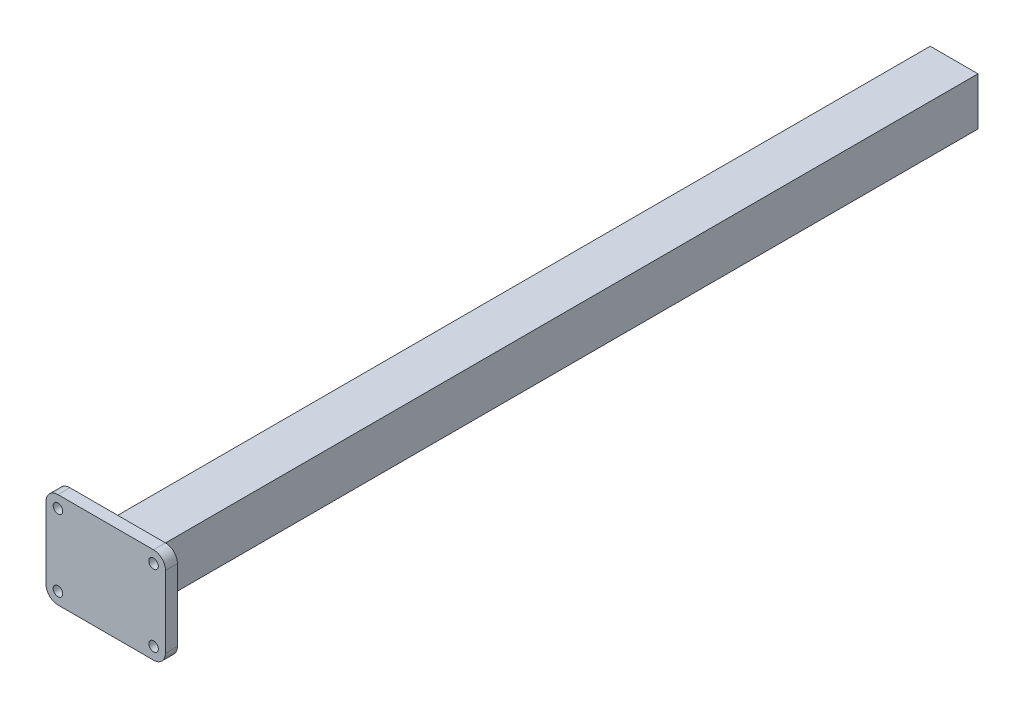
ISO-10303-21;
HEADER;
FILE_DESCRIPTION(('STEP AP214'),'2;1');
FILE_NAME('part.step','',(''),(''),'','','');
FILE_SCHEMA(('AUTOMOTIVE_DESIGN { 1 0 10303 214 1 1 1 1 }'));
ENDSEC;
DATA;
#1=APPLICATION_CONTEXT('core data for automotive mechanical design processes');
#2=APPLICATION_PROTOCOL_DEFINITION('international standard','automotive_design',2000,#1);
#3=PRODUCT_CONTEXT('',#1,'mechanical');
#4=PRODUCT('Part','Part','',(#3));
#5=PRODUCT_RELATED_PRODUCT_CATEGORY('part','',(#4));
#6=PRODUCT_DEFINITION_FORMATION('','',#4);
#7=PRODUCT_DEFINITION_CONTEXT('part definition',#1,'design');
#8=PRODUCT_DEFINITION('design','',#6,#7);
#9=PRODUCT_DEFINITION_SHAPE('','',#8);
#10=(LENGTH_UNIT() NAMED_UNIT(*) SI_UNIT(.MILLI.,.METRE.));
#11=(NAMED_UNIT(*) PLANE_ANGLE_UNIT() SI_UNIT($,.RADIAN.));
#12=(NAMED_UNIT(*) SI_UNIT($,.STERADIAN.) SOLID_ANGLE_UNIT());
#13=UNCERTAINTY_MEASURE_WITH_UNIT(LENGTH_MEASURE(1.E-05),#10,'distance_accuracy_value','');
#14=(GEOMETRIC_REPRESENTATION_CONTEXT(3) GLOBAL_UNCERTAINTY_ASSIGNED_CONTEXT((#13)) GLOBAL_UNIT_ASSIGNED_CONTEXT((#10,
#11,#12)) REPRESENTATION_CONTEXT('',''));
#15=CARTESIAN_POINT('',(0.,0.,0.));
#16=DIRECTION('',(0.,0.,1.));
#17=DIRECTION('',(1.,0.,0.));
#18=AXIS2_PLACEMENT_3D('',#15,#16,#17);
#19=CARTESIAN_POINT('',(0.,0.,0.));
#20=DIRECTION('',(0.,0.,-1.));
#21=DIRECTION('',(-1.,0.,0.));
#22=AXIS2_PLACEMENT_3D('',#19,#20,#21);
#23=PLANE('',#22);
#24=DIRECTION('',(0.,1.,0.));
#25=VECTOR('',#24,1.);
#26=CARTESIAN_POINT('',(20.,-20.,0.));
#27=LINE('',#26,#25);
#28=CARTESIAN_POINT('',(20.,-20.,0.));
#29=VERTEX_POINT('',#28);
#30=CARTESIAN_POINT('',(20.,20.,0.));
#31=VERTEX_POINT('',#30);
#32=EDGE_CURVE('E218',#29,#31,#27,.T.);
#33=ORIENTED_EDGE('',*,*,#32,.F.);
#34=DIRECTION('',(1.,0.,0.));
#35=VECTOR('',#34,1.);
#36=CARTESIAN_POINT('',(-20.,-20.,0.));
#37=LINE('',#36,#35);
#38=CARTESIAN_POINT('',(-20.,-20.,0.));
#39=VERTEX_POINT('',#38);
#40=EDGE_CURVE('E77',#39,#29,#37,.T.);
#41=ORIENTED_EDGE('',*,*,#40,.F.);
#42=DIRECTION('',(0.,-1.,0.));
#43=VECTOR('',#42,1.);
#44=CARTESIAN_POINT('',(-20.,-20.,0.));
#45=LINE('',#44,#43);
#46=CARTESIAN_POINT('',(-20.,20.,0.));
#47=VERTEX_POINT('',#46);
#48=EDGE_CURVE('E234',#47,#39,#45,.T.);
#49=ORIENTED_EDGE('',*,*,#48,.F.);
#50=DIRECTION('',(-1.,0.,0.));
#51=VECTOR('',#50,1.);
#52=CARTESIAN_POINT('',(-20.,20.,0.));
#53=LINE('',#52,#51);
#54=EDGE_CURVE('E232',#31,#47,#53,.T.);
#55=ORIENTED_EDGE('',*,*,#54,.F.);
#56=EDGE_LOOP('',(#33,#41,#49,#55));
#57=FACE_BOUND('',#56,.T.);
#58=DIRECTION('',(1.,0.,0.));
#59=VECTOR('',#58,1.);
#60=CARTESIAN_POINT('',(-18.5,-18.5,0.));
#61=LINE('',#60,#59);
#62=CARTESIAN_POINT('',(-18.5,-18.5,0.));
#63=VERTEX_POINT('',#62);
#64=CARTESIAN_POINT('',(18.5,-18.5,0.));
#65=VERTEX_POINT('',#64);
#66=EDGE_CURVE('E194',#63,#65,#61,.T.);
#67=ORIENTED_EDGE('',*,*,#66,.T.);
#68=DIRECTION('',(0.,1.,0.));
#69=VECTOR('',#68,1.);
#70=CARTESIAN_POINT('',(18.5,-18.5,0.));
#71=LINE('',#70,#69);
#72=CARTESIAN_POINT('',(18.5,18.5,0.));
#73=VERTEX_POINT('',#72);
#74=EDGE_CURVE('E48',#65,#73,#71,.T.);
#75=ORIENTED_EDGE('',*,*,#74,.T.);
#76=DIRECTION('',(-1.,0.,0.));
#77=VECTOR('',#76,1.);
#78=CARTESIAN_POINT('',(-18.5,18.5,0.));
#79=LINE('',#78,#77);
#80=CARTESIAN_POINT('',(-18.5,18.5,0.));
#81=VERTEX_POINT('',#80);
#82=EDGE_CURVE('E184',#73,#81,#79,.T.);
#83=ORIENTED_EDGE('',*,*,#82,.T.);
#84=DIRECTION('',(0.,-1.,0.));
#85=VECTOR('',#84,1.);
#86=CARTESIAN_POINT('',(-18.5,-18.5,0.));
#87=LINE('',#86,#85);
#88=EDGE_CURVE('E206',#81,#63,#87,.T.);
#89=ORIENTED_EDGE('',*,*,#88,.T.);
#90=EDGE_LOOP('',(#67,#75,#83,#89));
#91=FACE_BOUND('',#90,.T.);
#92=ADVANCED_FACE('F33',(#57,#91),#23,.T.);
#93=CARTESIAN_POINT('',(20.,-20.,700.));
#94=DIRECTION('',(-1.,0.,0.));
#95=DIRECTION('',(0.,0.,1.));
#96=AXIS2_PLACEMENT_3D('',#93,#94,#95);
#97=PLANE('',#96);
#98=ORIENTED_EDGE('',*,*,#32,.T.);
#99=DIRECTION('',(0.,0.,-1.));
#100=VECTOR('',#99,1.);
#101=CARTESIAN_POINT('',(20.,20.,700.));
#102=LINE('',#101,#100);
#103=CARTESIAN_POINT('',(20.,20.,700.));
#104=VERTEX_POINT('',#103);
#105=EDGE_CURVE('E11',#104,#31,#102,.T.);
#106=ORIENTED_EDGE('',*,*,#105,.F.);
#107=DIRECTION('',(0.,1.,0.));
#108=VECTOR('',#107,1.);
#109=CARTESIAN_POINT('',(20.,-20.,700.));
#110=LINE('',#109,#108);
#111=CARTESIAN_POINT('',(20.,-20.,700.));
#112=VERTEX_POINT('',#111);
#113=EDGE_CURVE('E219',#112,#104,#110,.T.);
#114=ORIENTED_EDGE('',*,*,#113,.F.);
#115=DIRECTION('',(0.,0.,-1.));
#116=VECTOR('',#115,1.);
#117=CARTESIAN_POINT('',(20.,-20.,700.));
#118=LINE('',#117,#116);
#119=EDGE_CURVE('E229',#112,#29,#118,.T.);
#120=ORIENTED_EDGE('',*,*,#119,.T.);
#121=EDGE_LOOP('',(#98,#106,#114,#120));
#122=FACE_BOUND('',#121,.T.);
#123=ADVANCED_FACE('F35',(#122),#97,.F.);
#124=CARTESIAN_POINT('',(-20.,20.,700.));
#125=DIRECTION('',(0.,-1.,0.));
#126=DIRECTION('',(0.,0.,-1.));
#127=AXIS2_PLACEMENT_3D('',#124,#125,#126);
#128=PLANE('',#127);
#129=ORIENTED_EDGE('',*,*,#54,.T.);
#130=DIRECTION('',(0.,0.,-1.));
#131=VECTOR('',#130,1.);
#132=CARTESIAN_POINT('',(-20.,20.,700.));
#133=LINE('',#132,#131);
#134=CARTESIAN_POINT('',(-20.,20.,700.));
#135=VERTEX_POINT('',#134);
#136=EDGE_CURVE('E41',#135,#47,#133,.T.);
#137=ORIENTED_EDGE('',*,*,#136,.F.);
#138=DIRECTION('',(-1.,0.,0.));
#139=VECTOR('',#138,1.);
#140=CARTESIAN_POINT('',(-20.,20.,700.));
#141=LINE('',#140,#139);
#142=EDGE_CURVE('E82',#104,#135,#141,.T.);
#143=ORIENTED_EDGE('',*,*,#142,.F.);
#144=ORIENTED_EDGE('',*,*,#105,.T.);
#145=EDGE_LOOP('',(#129,#137,#143,#144));
#146=FACE_BOUND('',#145,.T.);
#147=ADVANCED_FACE('F366',(#146),#128,.F.);
#148=CARTESIAN_POINT('',(-20.,-20.,700.));
#149=DIRECTION('',(1.,0.,0.));
#150=DIRECTION('',(0.,0.,-1.));
#151=AXIS2_PLACEMENT_3D('',#148,#149,#150);
#152=PLANE('',#151);
#153=ORIENTED_EDGE('',*,*,#48,.T.);
#154=DIRECTION('',(0.,0.,-1.));
#155=VECTOR('',#154,1.);
#156=CARTESIAN_POINT('',(-20.,-20.,700.));
#157=LINE('',#156,#155);
#158=CARTESIAN_POINT('',(-20.,-20.,700.));
#159=VERTEX_POINT('',#158);
#160=EDGE_CURVE('E57',#159,#39,#157,.T.);
#161=ORIENTED_EDGE('',*,*,#160,.F.);
#162=DIRECTION('',(0.,-1.,0.));
#163=VECTOR('',#162,1.);
#164=CARTESIAN_POINT('',(-20.,-20.,700.));
#165=LINE('',#164,#163);
#166=EDGE_CURVE('E223',#135,#159,#165,.T.);
#167=ORIENTED_EDGE('',*,*,#166,.F.);
#168=ORIENTED_EDGE('',*,*,#136,.T.);
#169=EDGE_LOOP('',(#153,#161,#167,#168));
#170=FACE_BOUND('',#169,.T.);
#171=ADVANCED_FACE('F240',(#170),#152,.F.);
#172=CARTESIAN_POINT('',(-20.,-20.,700.));
#173=DIRECTION('',(0.,1.,0.));
#174=DIRECTION('',(0.,0.,1.));
#175=AXIS2_PLACEMENT_3D('',#172,#173,#174);
#176=PLANE('',#175);
#177=ORIENTED_EDGE('',*,*,#40,.T.);
#178=ORIENTED_EDGE('',*,*,#119,.F.);
#179=DIRECTION('',(1.,0.,0.));
#180=VECTOR('',#179,1.);
#181=CARTESIAN_POINT('',(-20.,-20.,700.));
#182=LINE('',#181,#180);
#183=EDGE_CURVE('E226',#159,#112,#182,.T.);
#184=ORIENTED_EDGE('',*,*,#183,.F.);
#185=ORIENTED_EDGE('',*,*,#160,.T.);
#186=EDGE_LOOP('',(#177,#178,#184,#185));
#187=FACE_BOUND('',#186,.T.);
#188=ADVANCED_FACE('F245',(#187),#176,.F.);
#189=CARTESIAN_POINT('',(18.5,-18.5,700.));
#190=DIRECTION('',(-1.,0.,0.));
#191=DIRECTION('',(0.,0.,1.));
#192=AXIS2_PLACEMENT_3D('',#189,#190,#191);
#193=PLANE('',#192);
#194=ORIENTED_EDGE('',*,*,#74,.F.);
#195=DIRECTION('',(0.,0.,-1.));
#196=VECTOR('',#195,1.);
#197=CARTESIAN_POINT('',(18.5,-18.5,700.));
#198=LINE('',#197,#196);
#199=CARTESIAN_POINT('',(18.5,-18.5,700.));
#200=VERTEX_POINT('',#199);
#201=EDGE_CURVE('E202',#200,#65,#198,.T.);
#202=ORIENTED_EDGE('',*,*,#201,.F.);
#203=DIRECTION('',(0.,1.,0.));
#204=VECTOR('',#203,1.);
#205=CARTESIAN_POINT('',(18.5,-18.5,700.));
#206=LINE('',#205,#204);
#207=CARTESIAN_POINT('',(18.5,18.5,700.));
#208=VERTEX_POINT('',#207);
#209=EDGE_CURVE('E190',#200,#208,#206,.T.);
#210=ORIENTED_EDGE('',*,*,#209,.T.);
#211=DIRECTION('',(0.,0.,-1.));
#212=VECTOR('',#211,1.);
#213=CARTESIAN_POINT('',(18.5,18.5,700.));
#214=LINE('',#213,#212);
#215=EDGE_CURVE('E216',#208,#73,#214,.T.);
#216=ORIENTED_EDGE('',*,*,#215,.T.);
#217=EDGE_LOOP('',(#194,#202,#210,#216));
#218=FACE_BOUND('',#217,.T.);
#219=ADVANCED_FACE('F369',(#218),#193,.T.);
#220=CARTESIAN_POINT('',(-18.5,18.5,700.));
#221=DIRECTION('',(0.,-1.,0.));
#222=DIRECTION('',(0.,0.,-1.));
#223=AXIS2_PLACEMENT_3D('',#220,#221,#222);
#224=PLANE('',#223);
#225=ORIENTED_EDGE('',*,*,#82,.F.);
#226=ORIENTED_EDGE('',*,*,#215,.F.);
#227=DIRECTION('',(-1.,0.,0.));
#228=VECTOR('',#227,1.);
#229=CARTESIAN_POINT('',(-18.5,18.5,700.));
#230=LINE('',#229,#228);
#231=CARTESIAN_POINT('',(-18.5,18.5,700.));
#232=VERTEX_POINT('',#231);
#233=EDGE_CURVE('E193',#208,#232,#230,.T.);
#234=ORIENTED_EDGE('',*,*,#233,.T.);
#235=DIRECTION('',(0.,0.,-1.));
#236=VECTOR('',#235,1.);
#237=CARTESIAN_POINT('',(-18.5,18.5,700.));
#238=LINE('',#237,#236);
#239=EDGE_CURVE('E214',#232,#81,#238,.T.);
#240=ORIENTED_EDGE('',*,*,#239,.T.);
#241=EDGE_LOOP('',(#225,#226,#234,#240));
#242=FACE_BOUND('',#241,.T.);
#243=ADVANCED_FACE('F393',(#242),#224,.T.);
#244=CARTESIAN_POINT('',(-18.5,-18.5,700.));
#245=DIRECTION('',(1.,0.,0.));
#246=DIRECTION('',(0.,0.,-1.));
#247=AXIS2_PLACEMENT_3D('',#244,#245,#246);
#248=PLANE('',#247);
#249=ORIENTED_EDGE('',*,*,#88,.F.);
#250=ORIENTED_EDGE('',*,*,#239,.F.);
#251=DIRECTION('',(0.,-1.,0.));
#252=VECTOR('',#251,1.);
#253=CARTESIAN_POINT('',(-18.5,-18.5,700.));
#254=LINE('',#253,#252);
#255=CARTESIAN_POINT('',(-18.5,-18.5,700.));
#256=VERTEX_POINT('',#255);
#257=EDGE_CURVE('E197',#232,#256,#254,.T.);
#258=ORIENTED_EDGE('',*,*,#257,.T.);
#259=DIRECTION('',(0.,0.,-1.));
#260=VECTOR('',#259,1.);
#261=CARTESIAN_POINT('',(-18.5,-18.5,700.));
#262=LINE('',#261,#260);
#263=EDGE_CURVE('E212',#256,#63,#262,.T.);
#264=ORIENTED_EDGE('',*,*,#263,.T.);
#265=EDGE_LOOP('',(#249,#250,#258,#264));
#266=FACE_BOUND('',#265,.T.);
#267=ADVANCED_FACE('F399',(#266),#248,.T.);
#268=CARTESIAN_POINT('',(-18.5,-18.5,700.));
#269=DIRECTION('',(0.,1.,0.));
#270=DIRECTION('',(0.,0.,1.));
#271=AXIS2_PLACEMENT_3D('',#268,#269,#270);
#272=PLANE('',#271);
#273=ORIENTED_EDGE('',*,*,#66,.F.);
#274=ORIENTED_EDGE('',*,*,#263,.F.);
#275=DIRECTION('',(1.,0.,0.));
#276=VECTOR('',#275,1.);
#277=CARTESIAN_POINT('',(-18.5,-18.5,700.));
#278=LINE('',#277,#276);
#279=EDGE_CURVE('E200',#256,#200,#278,.T.);
#280=ORIENTED_EDGE('',*,*,#279,.T.);
#281=ORIENTED_EDGE('',*,*,#201,.T.);
#282=EDGE_LOOP('',(#273,#274,#280,#281));
#283=FACE_BOUND('',#282,.T.);
#284=ADVANCED_FACE('F406',(#283),#272,.T.);
#285=CARTESIAN_POINT('',(-40.,-30.,700.));
#286=DIRECTION('',(0.,0.,-1.));
#287=DIRECTION('',(-1.,0.,0.));
#288=AXIS2_PLACEMENT_3D('',#285,#286,#287);
#289=PLANE('',#288);
#290=ORIENTED_EDGE('',*,*,#209,.F.);
#291=ORIENTED_EDGE('',*,*,#279,.F.);
#292=ORIENTED_EDGE('',*,*,#257,.F.);
#293=ORIENTED_EDGE('',*,*,#233,.F.);
#294=EDGE_LOOP('',(#290,#291,#292,#293));
#295=FACE_BOUND('',#294,.T.);
#296=ADVANCED_FACE('F253',(#295),#289,.T.);
#297=CARTESIAN_POINT('',(-40.,-30.,710.));
#298=DIRECTION('',(0.,0.,-1.));
#299=DIRECTION('',(-1.,0.,0.));
#300=AXIS2_PLACEMENT_3D('',#297,#298,#299);
#301=CYLINDRICAL_SURFACE('',#300,10.);
#302=CARTESIAN_POINT('',(-40.,-30.,700.));
#303=DIRECTION('',(0.,0.,1.));
#304=DIRECTION('',(-1.,0.,0.));
#305=AXIS2_PLACEMENT_3D('',#302,#303,#304);
#306=CIRCLE('',#305,10.);
#307=CARTESIAN_POINT('',(-50.,-29.9999999999999,700.));
#308=VERTEX_POINT('',#307);
#309=CARTESIAN_POINT('',(-39.9999999999999,-40.,700.));
#310=VERTEX_POINT('',#309);
#311=EDGE_CURVE('E182',#308,#310,#306,.T.);
#312=ORIENTED_EDGE('',*,*,#311,.T.);
#313=DIRECTION('',(0.,0.,-1.));
#314=VECTOR('',#313,1.);
#315=CARTESIAN_POINT('',(-39.9999999999999,-40.,710.));
#316=LINE('',#315,#314);
#317=CARTESIAN_POINT('',(-39.9999999999999,-40.,710.));
#318=VERTEX_POINT('',#317);
#319=EDGE_CURVE('E162',#318,#310,#316,.T.);
#320=ORIENTED_EDGE('',*,*,#319,.F.);
#321=CARTESIAN_POINT('',(-40.,-30.,710.));
#322=DIRECTION('',(0.,0.,1.));
#323=DIRECTION('',(-1.,0.,0.));
#324=AXIS2_PLACEMENT_3D('',#321,#322,#323);
#325=CIRCLE('',#324,10.);
#326=CARTESIAN_POINT('',(-50.,-29.9999999999999,710.));
#327=VERTEX_POINT('',#326);
#328=EDGE_CURVE('E169',#327,#318,#325,.T.);
#329=ORIENTED_EDGE('',*,*,#328,.F.);
#330=DIRECTION('',(0.,0.,-1.));
#331=VECTOR('',#330,1.);
#332=CARTESIAN_POINT('',(-50.,-29.9999999999999,710.));
#333=LINE('',#332,#331);
#334=EDGE_CURVE('E278',#327,#308,#333,.T.);
#335=ORIENTED_EDGE('',*,*,#334,.T.);
#336=EDGE_LOOP('',(#312,#320,#329,#335));
#337=FACE_BOUND('',#336,.T.);
#338=ADVANCED_FACE('F180',(#337),#301,.T.);
#339=CARTESIAN_POINT('',(-39.9999999999999,-40.,710.));
#340=DIRECTION('',(0.,1.,0.));
#341=DIRECTION('',(0.,0.,1.));
#342=AXIS2_PLACEMENT_3D('',#339,#340,#341);
#343=PLANE('',#342);
#344=DIRECTION('',(1.,0.,0.));
#345=VECTOR('',#344,1.);
#346=CARTESIAN_POINT('',(-39.9999999999999,-40.,700.));
#347=LINE('',#346,#345);
#348=CARTESIAN_POINT('',(40.,-40.,700.));
#349=VERTEX_POINT('',#348);
#350=EDGE_CURVE('E257',#310,#349,#347,.T.);
#351=ORIENTED_EDGE('',*,*,#350,.T.);
#352=DIRECTION('',(0.,0.,-1.));
#353=VECTOR('',#352,1.);
#354=CARTESIAN_POINT('',(40.,-40.,710.));
#355=LINE('',#354,#353);
#356=CARTESIAN_POINT('',(40.,-40.,710.));
#357=VERTEX_POINT('',#356);
#358=EDGE_CURVE('E165',#357,#349,#355,.T.);
#359=ORIENTED_EDGE('',*,*,#358,.F.);
#360=DIRECTION('',(1.,0.,0.));
#361=VECTOR('',#360,1.);
#362=CARTESIAN_POINT('',(-39.9999999999999,-40.,710.));
#363=LINE('',#362,#361);
#364=EDGE_CURVE('E158',#318,#357,#363,.T.);
#365=ORIENTED_EDGE('',*,*,#364,.F.);
#366=ORIENTED_EDGE('',*,*,#319,.T.);
#367=EDGE_LOOP('',(#351,#359,#365,#366));
#368=FACE_BOUND('',#367,.T.);
#369=ADVANCED_FACE('F160',(#368),#343,.F.);
#370=CARTESIAN_POINT('',(40.,-30.,710.));
#371=DIRECTION('',(0.,0.,-1.));
#372=DIRECTION('',(-1.,0.,0.));
#373=AXIS2_PLACEMENT_3D('',#370,#371,#372);
#374=CYLINDRICAL_SURFACE('',#373,10.);
#375=CARTESIAN_POINT('',(40.,-30.,700.));
#376=DIRECTION('',(0.,0.,1.));
#377=DIRECTION('',(1.,0.,0.));
#378=AXIS2_PLACEMENT_3D('',#375,#376,#377);
#379=CIRCLE('',#378,10.);
#380=CARTESIAN_POINT('',(50.,-30.,700.));
#381=VERTEX_POINT('',#380);
#382=EDGE_CURVE('E260',#349,#381,#379,.T.);
#383=ORIENTED_EDGE('',*,*,#382,.T.);
#384=DIRECTION('',(0.,0.,-1.));
#385=VECTOR('',#384,1.);
#386=CARTESIAN_POINT('',(50.,-30.,710.));
#387=LINE('',#386,#385);
#388=CARTESIAN_POINT('',(50.,-30.,710.));
#389=VERTEX_POINT('',#388);
#390=EDGE_CURVE('E186',#389,#381,#387,.T.);
#391=ORIENTED_EDGE('',*,*,#390,.F.);
#392=CARTESIAN_POINT('',(40.,-30.,710.));
#393=DIRECTION('',(0.,0.,1.));
#394=DIRECTION('',(1.,0.,0.));
#395=AXIS2_PLACEMENT_3D('',#392,#393,#394);
#396=CIRCLE('',#395,10.);
#397=EDGE_CURVE('E168',#357,#389,#396,.T.);
#398=ORIENTED_EDGE('',*,*,#397,.F.);
#399=ORIENTED_EDGE('',*,*,#358,.T.);
#400=EDGE_LOOP('',(#383,#391,#398,#399));
#401=FACE_BOUND('',#400,.T.);
#402=ADVANCED_FACE('F433',(#401),#374,.T.);
#403=CARTESIAN_POINT('',(50.,-29.9999999999999,710.));
#404=DIRECTION('',(-1.,0.,0.));
#405=DIRECTION('',(0.,0.,1.));
#406=AXIS2_PLACEMENT_3D('',#403,#404,#405);
#407=PLANE('',#406);
#408=DIRECTION('',(0.,1.,0.));
#409=VECTOR('',#408,1.);
#410=CARTESIAN_POINT('',(50.,-29.9999999999999,700.));
#411=LINE('',#410,#409);
#412=CARTESIAN_POINT('',(50.,29.9999999999999,700.));
#413=VERTEX_POINT('',#412);
#414=EDGE_CURVE('E269',#381,#413,#411,.T.);
#415=ORIENTED_EDGE('',*,*,#414,.T.);
#416=DIRECTION('',(0.,0.,-1.));
#417=VECTOR('',#416,1.);
#418=CARTESIAN_POINT('',(50.,29.9999999999999,710.));
#419=LINE('',#418,#417);
#420=CARTESIAN_POINT('',(50.,29.9999999999999,710.));
#421=VERTEX_POINT('',#420);
#422=EDGE_CURVE('E289',#421,#413,#419,.T.);
#423=ORIENTED_EDGE('',*,*,#422,.F.);
#424=DIRECTION('',(0.,1.,0.));
#425=VECTOR('',#424,1.);
#426=CARTESIAN_POINT('',(50.,-29.9999999999999,710.));
#427=LINE('',#426,#425);
#428=EDGE_CURVE('E298',#389,#421,#427,.T.);
#429=ORIENTED_EDGE('',*,*,#428,.F.);
#430=ORIENTED_EDGE('',*,*,#390,.T.);
#431=EDGE_LOOP('',(#415,#423,#429,#430));
#432=FACE_BOUND('',#431,.T.);
#433=ADVANCED_FACE('F296',(#432),#407,.F.);
#434=CARTESIAN_POINT('',(40.,30.,710.));
#435=DIRECTION('',(0.,0.,-1.));
#436=DIRECTION('',(-1.,0.,0.));
#437=AXIS2_PLACEMENT_3D('',#434,#435,#436);
#438=CYLINDRICAL_SURFACE('',#437,10.);
#439=CARTESIAN_POINT('',(40.,30.,700.));
#440=DIRECTION('',(0.,0.,1.));
#441=DIRECTION('',(-1.,0.,0.));
#442=AXIS2_PLACEMENT_3D('',#439,#440,#441);
#443=CIRCLE('',#442,10.);
#444=CARTESIAN_POINT('',(40.,40.,700.));
#445=VERTEX_POINT('',#444);
#446=EDGE_CURVE('E271',#413,#445,#443,.T.);
#447=ORIENTED_EDGE('',*,*,#446,.T.);
#448=DIRECTION('',(0.,0.,-1.));
#449=VECTOR('',#448,1.);
#450=CARTESIAN_POINT('',(40.,40.,710.));
#451=LINE('',#450,#449);
#452=CARTESIAN_POINT('',(40.,40.,710.));
#453=VERTEX_POINT('',#452);
#454=EDGE_CURVE('E286',#453,#445,#451,.T.);
#455=ORIENTED_EDGE('',*,*,#454,.F.);
#456=CARTESIAN_POINT('',(40.,30.,710.));
#457=DIRECTION('',(0.,0.,1.));
#458=DIRECTION('',(-1.,0.,0.));
#459=AXIS2_PLACEMENT_3D('',#456,#457,#458);
#460=CIRCLE('',#459,10.);
#461=EDGE_CURVE('E313',#421,#453,#460,.T.);
#462=ORIENTED_EDGE('',*,*,#461,.F.);
#463=ORIENTED_EDGE('',*,*,#422,.T.);
#464=EDGE_LOOP('',(#447,#455,#462,#463));
#465=FACE_BOUND('',#464,.T.);
#466=ADVANCED_FACE('F304',(#465),#438,.T.);
#467=CARTESIAN_POINT('',(-39.9999999999999,40.,710.));
#468=DIRECTION('',(0.,-1.,0.));
#469=DIRECTION('',(0.,0.,-1.));
#470=AXIS2_PLACEMENT_3D('',#467,#468,#469);
#471=PLANE('',#470);
#472=DIRECTION('',(-1.,0.,0.));
#473=VECTOR('',#472,1.);
#474=CARTESIAN_POINT('',(-39.9999999999999,40.,700.));
#475=LINE('',#474,#473);
#476=CARTESIAN_POINT('',(-39.9999999999999,40.,700.));
#477=VERTEX_POINT('',#476);
#478=EDGE_CURVE('E273',#445,#477,#475,.T.);
#479=ORIENTED_EDGE('',*,*,#478,.T.);
#480=DIRECTION('',(0.,0.,-1.));
#481=VECTOR('',#480,1.);
#482=CARTESIAN_POINT('',(-39.9999999999999,40.,710.));
#483=LINE('',#482,#481);
#484=CARTESIAN_POINT('',(-39.9999999999999,40.,710.));
#485=VERTEX_POINT('',#484);
#486=EDGE_CURVE('E283',#485,#477,#483,.T.);
#487=ORIENTED_EDGE('',*,*,#486,.F.);
#488=DIRECTION('',(-1.,0.,0.));
#489=VECTOR('',#488,1.);
#490=CARTESIAN_POINT('',(-39.9999999999999,40.,710.));
#491=LINE('',#490,#489);
#492=EDGE_CURVE('E310',#453,#485,#491,.T.);
#493=ORIENTED_EDGE('',*,*,#492,.F.);
#494=ORIENTED_EDGE('',*,*,#454,.T.);
#495=EDGE_LOOP('',(#479,#487,#493,#494));
#496=FACE_BOUND('',#495,.T.);
#497=ADVANCED_FACE('F308',(#496),#471,.F.);
#498=CARTESIAN_POINT('',(-40.,30.,710.));
#499=DIRECTION('',(0.,0.,-1.));
#500=DIRECTION('',(-1.,0.,0.));
#501=AXIS2_PLACEMENT_3D('',#498,#499,#500);
#502=CYLINDRICAL_SURFACE('',#501,10.);
#503=CARTESIAN_POINT('',(-40.,30.,700.));
#504=DIRECTION('',(0.,0.,1.));
#505=DIRECTION('',(-1.,0.,0.));
#506=AXIS2_PLACEMENT_3D('',#503,#504,#505);
#507=CIRCLE('',#506,10.);
#508=CARTESIAN_POINT('',(-50.,29.9999999999999,700.));
#509=VERTEX_POINT('',#508);
#510=EDGE_CURVE('E275',#477,#509,#507,.T.);
#511=ORIENTED_EDGE('',*,*,#510,.T.);
#512=DIRECTION('',(0.,0.,-1.));
#513=VECTOR('',#512,1.);
#514=CARTESIAN_POINT('',(-50.,29.9999999999999,710.));
#515=LINE('',#514,#513);
#516=CARTESIAN_POINT('',(-50.,29.9999999999999,710.));
#517=VERTEX_POINT('',#516);
#518=EDGE_CURVE('E280',#517,#509,#515,.T.);
#519=ORIENTED_EDGE('',*,*,#518,.F.);
#520=CARTESIAN_POINT('',(-40.,30.,710.));
#521=DIRECTION('',(0.,0.,1.));
#522=DIRECTION('',(-1.,0.,0.));
#523=AXIS2_PLACEMENT_3D('',#520,#521,#522);
#524=CIRCLE('',#523,10.);
#525=EDGE_CURVE('E312',#485,#517,#524,.T.);
#526=ORIENTED_EDGE('',*,*,#525,.F.);
#527=ORIENTED_EDGE('',*,*,#486,.T.);
#528=EDGE_LOOP('',(#511,#519,#526,#527));
#529=FACE_BOUND('',#528,.T.);
#530=ADVANCED_FACE('F458',(#529),#502,.T.);
#531=CARTESIAN_POINT('',(-50.,-29.9999999999999,710.));
#532=DIRECTION('',(1.,0.,0.));
#533=DIRECTION('',(0.,0.,-1.));
#534=AXIS2_PLACEMENT_3D('',#531,#532,#533);
#535=PLANE('',#534);
#536=DIRECTION('',(0.,-1.,0.));
#537=VECTOR('',#536,1.);
#538=CARTESIAN_POINT('',(-50.,-29.9999999999999,700.));
#539=LINE('',#538,#537);
#540=EDGE_CURVE('E178',#509,#308,#539,.T.);
#541=ORIENTED_EDGE('',*,*,#540,.T.);
#542=ORIENTED_EDGE('',*,*,#334,.F.);
#543=DIRECTION('',(0.,-1.,0.));
#544=VECTOR('',#543,1.);
#545=CARTESIAN_POINT('',(-50.,-29.9999999999999,710.));
#546=LINE('',#545,#544);
#547=EDGE_CURVE('E174',#517,#327,#546,.T.);
#548=ORIENTED_EDGE('',*,*,#547,.F.);
#549=ORIENTED_EDGE('',*,*,#518,.T.);
#550=EDGE_LOOP('',(#541,#542,#548,#549));
#551=FACE_BOUND('',#550,.T.);
#552=ADVANCED_FACE('F465',(#551),#535,.F.);
#553=CARTESIAN_POINT('',(-40.,-30.,710.));
#554=DIRECTION('',(0.,0.,-1.));
#555=DIRECTION('',(-1.,0.,0.));
#556=AXIS2_PLACEMENT_3D('',#553,#554,#555);
#557=PLANE('',#556);
#558=CARTESIAN_POINT('',(-40.,-30.,710.));
#559=DIRECTION('',(0.,0.,-1.));
#560=DIRECTION('',(-1.,0.,0.));
#561=AXIS2_PLACEMENT_3D('',#558,#559,#560);
#562=CIRCLE('',#561,4.00000000000001);
#563=CARTESIAN_POINT('',(-44.,-30.,710.));
#564=VERTEX_POINT('',#563);
#565=EDGE_CURVE('E325',#564,#564,#562,.T.);
#566=ORIENTED_EDGE('',*,*,#565,.T.);
#567=EDGE_LOOP('',(#566));
#568=FACE_BOUND('',#567,.T.);
#569=CARTESIAN_POINT('',(40.,-30.,710.));
#570=DIRECTION('',(0.,0.,-1.));
#571=DIRECTION('',(-1.,0.,0.));
#572=AXIS2_PLACEMENT_3D('',#569,#570,#571);
#573=CIRCLE('',#572,4.00000000000001);
#574=CARTESIAN_POINT('',(36.,-30.,710.));
#575=VERTEX_POINT('',#574);
#576=EDGE_CURVE('E331',#575,#575,#573,.T.);
#577=ORIENTED_EDGE('',*,*,#576,.T.);
#578=EDGE_LOOP('',(#577));
#579=FACE_BOUND('',#578,.T.);
#580=CARTESIAN_POINT('',(40.,30.,710.));
#581=DIRECTION('',(0.,0.,-1.));
#582=DIRECTION('',(-1.,0.,0.));
#583=AXIS2_PLACEMENT_3D('',#580,#581,#582);
#584=CIRCLE('',#583,4.00000000000001);
#585=CARTESIAN_POINT('',(36.,30.,710.));
#586=VERTEX_POINT('',#585);
#587=EDGE_CURVE('E320',#586,#586,#584,.T.);
#588=ORIENTED_EDGE('',*,*,#587,.T.);
#589=EDGE_LOOP('',(#588));
#590=FACE_BOUND('',#589,.T.);
#591=CARTESIAN_POINT('',(-40.,30.,710.));
#592=DIRECTION('',(0.,0.,-1.));
#593=DIRECTION('',(-1.,0.,0.));
#594=AXIS2_PLACEMENT_3D('',#591,#592,#593);
#595=CIRCLE('',#594,4.00000000000001);
#596=CARTESIAN_POINT('',(-44.,30.,710.));
#597=VERTEX_POINT('',#596);
#598=EDGE_CURVE('E258',#597,#597,#595,.T.);
#599=ORIENTED_EDGE('',*,*,#598,.T.);
#600=EDGE_LOOP('',(#599));
#601=FACE_BOUND('',#600,.T.);
#602=ORIENTED_EDGE('',*,*,#328,.T.);
#603=ORIENTED_EDGE('',*,*,#364,.T.);
#604=ORIENTED_EDGE('',*,*,#397,.T.);
#605=ORIENTED_EDGE('',*,*,#428,.T.);
#606=ORIENTED_EDGE('',*,*,#461,.T.);
#607=ORIENTED_EDGE('',*,*,#492,.T.);
#608=ORIENTED_EDGE('',*,*,#525,.T.);
#609=ORIENTED_EDGE('',*,*,#547,.T.);
#610=EDGE_LOOP('',(#602,#603,#604,#605,#606,#607,#608,#609));
#611=FACE_BOUND('',#610,.T.);
#612=ADVANCED_FACE('F172',(#568,#579,#590,#601,#611),#557,.F.);
#613=CARTESIAN_POINT('',(-40.,-30.,700.));
#614=DIRECTION('',(0.,0.,-1.));
#615=DIRECTION('',(-1.,0.,0.));
#616=AXIS2_PLACEMENT_3D('',#613,#614,#615);
#617=CIRCLE('',#616,4.00000000000001);
#618=CARTESIAN_POINT('',(-44.,-30.,700.));
#619=VERTEX_POINT('',#618);
#620=EDGE_CURVE('E322',#619,#619,#617,.T.);
#621=ORIENTED_EDGE('',*,*,#620,.F.);
#622=EDGE_LOOP('',(#621));
#623=FACE_BOUND('',#622,.T.);
#624=CARTESIAN_POINT('',(40.,-30.,700.));
#625=DIRECTION('',(0.,0.,-1.));
#626=DIRECTION('',(-1.,0.,0.));
#627=AXIS2_PLACEMENT_3D('',#624,#625,#626);
#628=CIRCLE('',#627,4.00000000000001);
#629=CARTESIAN_POINT('',(36.,-30.,700.));
#630=VERTEX_POINT('',#629);
#631=EDGE_CURVE('E328',#630,#630,#628,.T.);
#632=ORIENTED_EDGE('',*,*,#631,.F.);
#633=EDGE_LOOP('',(#632));
#634=FACE_BOUND('',#633,.T.);
#635=CARTESIAN_POINT('',(40.,30.,700.));
#636=DIRECTION('',(0.,0.,-1.));
#637=DIRECTION('',(-1.,0.,0.));
#638=AXIS2_PLACEMENT_3D('',#635,#636,#637);
#639=CIRCLE('',#638,4.00000000000001);
#640=CARTESIAN_POINT('',(36.,30.,700.));
#641=VERTEX_POINT('',#640);
#642=EDGE_CURVE('E334',#641,#641,#639,.T.);
#643=ORIENTED_EDGE('',*,*,#642,.F.);
#644=EDGE_LOOP('',(#643));
#645=FACE_BOUND('',#644,.T.);
#646=CARTESIAN_POINT('',(-40.,30.,700.));
#647=DIRECTION('',(0.,0.,-1.));
#648=DIRECTION('',(-1.,0.,0.));
#649=AXIS2_PLACEMENT_3D('',#646,#647,#648);
#650=CIRCLE('',#649,4.00000000000001);
#651=CARTESIAN_POINT('',(-44.,30.,700.));
#652=VERTEX_POINT('',#651);
#653=EDGE_CURVE('E263',#652,#652,#650,.T.);
#654=ORIENTED_EDGE('',*,*,#653,.F.);
#655=EDGE_LOOP('',(#654));
#656=FACE_BOUND('',#655,.T.);
#657=ORIENTED_EDGE('',*,*,#183,.T.);
#658=ORIENTED_EDGE('',*,*,#113,.T.);
#659=ORIENTED_EDGE('',*,*,#142,.T.);
#660=ORIENTED_EDGE('',*,*,#166,.T.);
#661=EDGE_LOOP('',(#657,#658,#659,#660));
#662=FACE_BOUND('',#661,.T.);
#663=ORIENTED_EDGE('',*,*,#311,.F.);
#664=ORIENTED_EDGE('',*,*,#540,.F.);
#665=ORIENTED_EDGE('',*,*,#510,.F.);
#666=ORIENTED_EDGE('',*,*,#478,.F.);
#667=ORIENTED_EDGE('',*,*,#446,.F.);
#668=ORIENTED_EDGE('',*,*,#414,.F.);
#669=ORIENTED_EDGE('',*,*,#382,.F.);
#670=ORIENTED_EDGE('',*,*,#350,.F.);
#671=EDGE_LOOP('',(#663,#664,#665,#666,#667,#668,#669,#670));
#672=FACE_BOUND('',#671,.T.);
#673=ADVANCED_FACE('F247',(#623,#634,#645,#656,#662,#672),#289,.T.);
#674=CARTESIAN_POINT('',(-40.,30.,710.));
#675=DIRECTION('',(0.,0.,-1.));
#676=DIRECTION('',(-1.,0.,0.));
#677=AXIS2_PLACEMENT_3D('',#674,#675,#676);
#678=CYLINDRICAL_SURFACE('',#677,4.00000000000001);
#679=ORIENTED_EDGE('',*,*,#598,.F.);
#680=EDGE_LOOP('',(#679));
#681=FACE_BOUND('',#680,.T.);
#682=ORIENTED_EDGE('',*,*,#653,.T.);
#683=EDGE_LOOP('',(#682));
#684=FACE_BOUND('',#683,.T.);
#685=ADVANCED_FACE('F250',(#681,#684),#678,.F.);
#686=CARTESIAN_POINT('',(40.,30.,710.));
#687=DIRECTION('',(0.,0.,-1.));
#688=DIRECTION('',(-1.,0.,0.));
#689=AXIS2_PLACEMENT_3D('',#686,#687,#688);
#690=CYLINDRICAL_SURFACE('',#689,4.00000000000001);
#691=ORIENTED_EDGE('',*,*,#587,.F.);
#692=EDGE_LOOP('',(#691));
#693=FACE_BOUND('',#692,.T.);
#694=ORIENTED_EDGE('',*,*,#642,.T.);
#695=EDGE_LOOP('',(#694));
#696=FACE_BOUND('',#695,.T.);
#697=ADVANCED_FACE('F342',(#693,#696),#690,.F.);
#698=CARTESIAN_POINT('',(40.,-30.,710.));
#699=DIRECTION('',(0.,0.,-1.));
#700=DIRECTION('',(-1.,0.,0.));
#701=AXIS2_PLACEMENT_3D('',#698,#699,#700);
#702=CYLINDRICAL_SURFACE('',#701,4.00000000000001);
#703=ORIENTED_EDGE('',*,*,#576,.F.);
#704=EDGE_LOOP('',(#703));
#705=FACE_BOUND('',#704,.T.);
#706=ORIENTED_EDGE('',*,*,#631,.T.);
#707=EDGE_LOOP('',(#706));
#708=FACE_BOUND('',#707,.T.);
#709=ADVANCED_FACE('F345',(#705,#708),#702,.F.);
#710=CARTESIAN_POINT('',(-40.,-30.,710.));
#711=DIRECTION('',(0.,0.,-1.));
#712=DIRECTION('',(-1.,0.,0.));
#713=AXIS2_PLACEMENT_3D('',#710,#711,#712);
#714=CYLINDRICAL_SURFACE('',#713,4.00000000000001);
#715=ORIENTED_EDGE('',*,*,#565,.F.);
#716=EDGE_LOOP('',(#715));
#717=FACE_BOUND('',#716,.T.);
#718=ORIENTED_EDGE('',*,*,#620,.T.);
#719=EDGE_LOOP('',(#718));
#720=FACE_BOUND('',#719,.T.);
#721=ADVANCED_FACE('F504',(#717,#720),#714,.F.);
#722=CLOSED_SHELL('',(#92,#123,#147,#171,#188,#219,#243,#267,#284,#296,#338,#369,#402,#433,#466,
#497,#530,#552,#612,#673,#685,#697,#709,#721));
#723=MANIFOLD_SOLID_BREP('B2',#722);
#724=ADVANCED_BREP_SHAPE_REPRESENTATION('',(#18,#723),#14);
#725=SHAPE_DEFINITION_REPRESENTATION(#9,#724);
ENDSEC;
END-ISO-10303-21;
